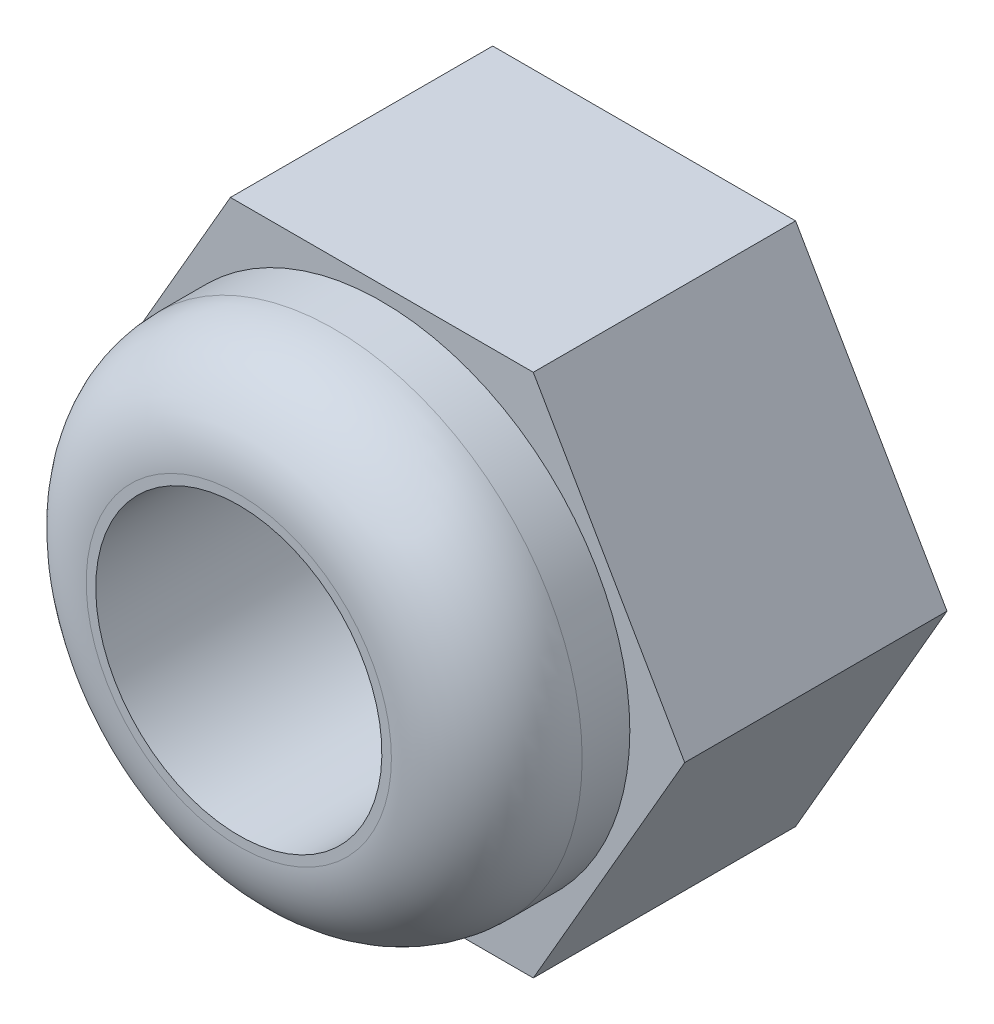
ISO-10303-21;
HEADER;
FILE_DESCRIPTION(('STEP AP214'),'2;1');
FILE_NAME('part.step','',(''),(''),'','','');
FILE_SCHEMA(('AUTOMOTIVE_DESIGN { 1 0 10303 214 1 1 1 1 }'));
ENDSEC;
DATA;
#1=APPLICATION_CONTEXT('core data for automotive mechanical design processes');
#2=APPLICATION_PROTOCOL_DEFINITION('international standard','automotive_design',2000,#1);
#3=PRODUCT_CONTEXT('',#1,'mechanical');
#4=PRODUCT('Part','Part','',(#3));
#5=PRODUCT_RELATED_PRODUCT_CATEGORY('part','',(#4));
#6=PRODUCT_DEFINITION_FORMATION('','',#4);
#7=PRODUCT_DEFINITION_CONTEXT('part definition',#1,'design');
#8=PRODUCT_DEFINITION('design','',#6,#7);
#9=PRODUCT_DEFINITION_SHAPE('','',#8);
#10=(LENGTH_UNIT() NAMED_UNIT(*) SI_UNIT(.MILLI.,.METRE.));
#11=(NAMED_UNIT(*) PLANE_ANGLE_UNIT() SI_UNIT($,.RADIAN.));
#12=(NAMED_UNIT(*) SI_UNIT($,.STERADIAN.) SOLID_ANGLE_UNIT());
#13=UNCERTAINTY_MEASURE_WITH_UNIT(LENGTH_MEASURE(1.E-05),#10,'distance_accuracy_value','');
#14=(GEOMETRIC_REPRESENTATION_CONTEXT(3) GLOBAL_UNCERTAINTY_ASSIGNED_CONTEXT((#13)) GLOBAL_UNIT_ASSIGNED_CONTEXT((#10,
#11,#12)) REPRESENTATION_CONTEXT('',''));
#15=CARTESIAN_POINT('',(0.,0.,0.));
#16=DIRECTION('',(0.,0.,1.));
#17=DIRECTION('',(1.,0.,0.));
#18=AXIS2_PLACEMENT_3D('',#15,#16,#17);
#19=CARTESIAN_POINT('',(-1.58771324027147,-2.75,0.));
#20=DIRECTION('',(0.,-1.,0.));
#21=DIRECTION('',(1.,0.,0.));
#22=AXIS2_PLACEMENT_3D('',#19,#20,#21);
#23=PLANE('',#22);
#24=DIRECTION('',(1.,0.,0.));
#25=VECTOR('',#24,1.);
#26=CARTESIAN_POINT('',(-1.58771324027147,-2.75,2.75));
#27=LINE('',#26,#25);
#28=CARTESIAN_POINT('',(-1.58771324027147,-2.75,2.75));
#29=VERTEX_POINT('',#28);
#30=CARTESIAN_POINT('',(1.58771324027147,-2.75,2.75));
#31=VERTEX_POINT('',#30);
#32=EDGE_CURVE('E122',#29,#31,#27,.T.);
#33=ORIENTED_EDGE('',*,*,#32,.F.);
#34=DIRECTION('',(0.,0.,1.));
#35=VECTOR('',#34,1.);
#36=CARTESIAN_POINT('',(-1.58771324027147,-2.75,0.));
#37=LINE('',#36,#35);
#38=CARTESIAN_POINT('',(-1.58771324027147,-2.75,0.));
#39=VERTEX_POINT('',#38);
#40=EDGE_CURVE('E51',#39,#29,#37,.T.);
#41=ORIENTED_EDGE('',*,*,#40,.F.);
#42=DIRECTION('',(1.,0.,0.));
#43=VECTOR('',#42,1.);
#44=CARTESIAN_POINT('',(-1.58771324027147,-2.75,0.));
#45=LINE('',#44,#43);
#46=CARTESIAN_POINT('',(1.58771324027147,-2.75,0.));
#47=VERTEX_POINT('',#46);
#48=EDGE_CURVE('E138',#39,#47,#45,.T.);
#49=ORIENTED_EDGE('',*,*,#48,.T.);
#50=DIRECTION('',(0.,0.,1.));
#51=VECTOR('',#50,1.);
#52=CARTESIAN_POINT('',(1.58771324027147,-2.75,0.));
#53=LINE('',#52,#51);
#54=EDGE_CURVE('E86',#47,#31,#53,.T.);
#55=ORIENTED_EDGE('',*,*,#54,.T.);
#56=EDGE_LOOP('',(#33,#41,#49,#55));
#57=FACE_BOUND('',#56,.T.);
#58=ADVANCED_FACE('F34',(#57),#23,.T.);
#59=CARTESIAN_POINT('',(-3.17542648054294,0.,0.));
#60=DIRECTION('',(-0.866025403784438,-0.500000000000001,0.));
#61=DIRECTION('',(0.500000000000001,-0.866025403784438,0.));
#62=AXIS2_PLACEMENT_3D('',#59,#60,#61);
#63=PLANE('',#62);
#64=DIRECTION('',(0.500000000000001,-0.866025403784438,0.));
#65=VECTOR('',#64,1.);
#66=CARTESIAN_POINT('',(-3.17542648054294,0.,2.75));
#67=LINE('',#66,#65);
#68=CARTESIAN_POINT('',(-3.17542648054294,0.,2.75));
#69=VERTEX_POINT('',#68);
#70=EDGE_CURVE('E135',#69,#29,#67,.T.);
#71=ORIENTED_EDGE('',*,*,#70,.F.);
#72=DIRECTION('',(0.,0.,1.));
#73=VECTOR('',#72,1.);
#74=CARTESIAN_POINT('',(-3.17542648054294,0.,0.));
#75=LINE('',#74,#73);
#76=CARTESIAN_POINT('',(-3.17542648054294,0.,0.));
#77=VERTEX_POINT('',#76);
#78=EDGE_CURVE('E74',#77,#69,#75,.T.);
#79=ORIENTED_EDGE('',*,*,#78,.F.);
#80=DIRECTION('',(0.500000000000001,-0.866025403784438,0.));
#81=VECTOR('',#80,1.);
#82=CARTESIAN_POINT('',(-3.17542648054294,0.,0.));
#83=LINE('',#82,#81);
#84=EDGE_CURVE('E112',#77,#39,#83,.T.);
#85=ORIENTED_EDGE('',*,*,#84,.T.);
#86=ORIENTED_EDGE('',*,*,#40,.T.);
#87=EDGE_LOOP('',(#71,#79,#85,#86));
#88=FACE_BOUND('',#87,.T.);
#89=ADVANCED_FACE('F163',(#88),#63,.T.);
#90=CARTESIAN_POINT('',(-1.58771324027147,2.75,0.));
#91=DIRECTION('',(-0.866025403784439,0.499999999999999,0.));
#92=DIRECTION('',(-0.499999999999999,-0.866025403784439,0.));
#93=AXIS2_PLACEMENT_3D('',#90,#91,#92);
#94=PLANE('',#93);
#95=DIRECTION('',(-0.499999999999999,-0.866025403784439,0.));
#96=VECTOR('',#95,1.);
#97=CARTESIAN_POINT('',(-1.58771324027147,2.75,2.75));
#98=LINE('',#97,#96);
#99=CARTESIAN_POINT('',(-1.58771324027147,2.75,2.75));
#100=VERTEX_POINT('',#99);
#101=EDGE_CURVE('E99',#100,#69,#98,.T.);
#102=ORIENTED_EDGE('',*,*,#101,.F.);
#103=DIRECTION('',(0.,0.,1.));
#104=VECTOR('',#103,1.);
#105=CARTESIAN_POINT('',(-1.58771324027147,2.75,0.));
#106=LINE('',#105,#104);
#107=CARTESIAN_POINT('',(-1.58771324027147,2.75,0.));
#108=VERTEX_POINT('',#107);
#109=EDGE_CURVE('E94',#108,#100,#106,.T.);
#110=ORIENTED_EDGE('',*,*,#109,.F.);
#111=DIRECTION('',(-0.499999999999999,-0.866025403784439,0.));
#112=VECTOR('',#111,1.);
#113=CARTESIAN_POINT('',(-1.58771324027147,2.75,0.));
#114=LINE('',#113,#112);
#115=EDGE_CURVE('E97',#108,#77,#114,.T.);
#116=ORIENTED_EDGE('',*,*,#115,.T.);
#117=ORIENTED_EDGE('',*,*,#78,.T.);
#118=EDGE_LOOP('',(#102,#110,#116,#117));
#119=FACE_BOUND('',#118,.T.);
#120=ADVANCED_FACE('F96',(#119),#94,.T.);
#121=CARTESIAN_POINT('',(1.58771324027147,2.75,0.));
#122=DIRECTION('',(0.,1.,0.));
#123=DIRECTION('',(-1.,0.,0.));
#124=AXIS2_PLACEMENT_3D('',#121,#122,#123);
#125=PLANE('',#124);
#126=DIRECTION('',(-1.,0.,0.));
#127=VECTOR('',#126,1.);
#128=CARTESIAN_POINT('',(1.58771324027147,2.75,2.75));
#129=LINE('',#128,#127);
#130=CARTESIAN_POINT('',(1.58771324027147,2.75,2.75));
#131=VERTEX_POINT('',#130);
#132=EDGE_CURVE('E132',#131,#100,#129,.T.);
#133=ORIENTED_EDGE('',*,*,#132,.F.);
#134=DIRECTION('',(0.,0.,1.));
#135=VECTOR('',#134,1.);
#136=CARTESIAN_POINT('',(1.58771324027147,2.75,0.));
#137=LINE('',#136,#135);
#138=CARTESIAN_POINT('',(1.58771324027147,2.75,0.));
#139=VERTEX_POINT('',#138);
#140=EDGE_CURVE('E104',#139,#131,#137,.T.);
#141=ORIENTED_EDGE('',*,*,#140,.F.);
#142=DIRECTION('',(-1.,0.,0.));
#143=VECTOR('',#142,1.);
#144=CARTESIAN_POINT('',(1.58771324027147,2.75,0.));
#145=LINE('',#144,#143);
#146=EDGE_CURVE('E110',#139,#108,#145,.T.);
#147=ORIENTED_EDGE('',*,*,#146,.T.);
#148=ORIENTED_EDGE('',*,*,#109,.T.);
#149=EDGE_LOOP('',(#133,#141,#147,#148));
#150=FACE_BOUND('',#149,.T.);
#151=ADVANCED_FACE('F114',(#150),#125,.T.);
#152=CARTESIAN_POINT('',(3.17542648054294,0.,0.));
#153=DIRECTION('',(0.866025403784438,0.500000000000001,0.));
#154=DIRECTION('',(-0.500000000000001,0.866025403784438,0.));
#155=AXIS2_PLACEMENT_3D('',#152,#153,#154);
#156=PLANE('',#155);
#157=DIRECTION('',(-0.500000000000001,0.866025403784438,0.));
#158=VECTOR('',#157,1.);
#159=CARTESIAN_POINT('',(3.17542648054294,0.,2.75));
#160=LINE('',#159,#158);
#161=CARTESIAN_POINT('',(3.17542648054294,0.,2.75));
#162=VERTEX_POINT('',#161);
#163=EDGE_CURVE('E129',#162,#131,#160,.T.);
#164=ORIENTED_EDGE('',*,*,#163,.F.);
#165=DIRECTION('',(0.,0.,1.));
#166=VECTOR('',#165,1.);
#167=CARTESIAN_POINT('',(3.17542648054294,0.,0.));
#168=LINE('',#167,#166);
#169=CARTESIAN_POINT('',(3.17542648054294,0.,0.));
#170=VERTEX_POINT('',#169);
#171=EDGE_CURVE('E143',#170,#162,#168,.T.);
#172=ORIENTED_EDGE('',*,*,#171,.F.);
#173=DIRECTION('',(-0.500000000000001,0.866025403784438,0.));
#174=VECTOR('',#173,1.);
#175=CARTESIAN_POINT('',(3.17542648054294,0.,0.));
#176=LINE('',#175,#174);
#177=EDGE_CURVE('E115',#170,#139,#176,.T.);
#178=ORIENTED_EDGE('',*,*,#177,.T.);
#179=ORIENTED_EDGE('',*,*,#140,.T.);
#180=EDGE_LOOP('',(#164,#172,#178,#179));
#181=FACE_BOUND('',#180,.T.);
#182=ADVANCED_FACE('F172',(#181),#156,.T.);
#183=CARTESIAN_POINT('',(1.58771324027147,-2.75,0.));
#184=DIRECTION('',(0.866025403784439,-0.5,0.));
#185=DIRECTION('',(0.5,0.866025403784439,0.));
#186=AXIS2_PLACEMENT_3D('',#183,#184,#185);
#187=PLANE('',#186);
#188=DIRECTION('',(0.5,0.866025403784439,0.));
#189=VECTOR('',#188,1.);
#190=CARTESIAN_POINT('',(1.58771324027147,-2.75,2.75));
#191=LINE('',#190,#189);
#192=EDGE_CURVE('E125',#31,#162,#191,.T.);
#193=ORIENTED_EDGE('',*,*,#192,.F.);
#194=ORIENTED_EDGE('',*,*,#54,.F.);
#195=DIRECTION('',(0.5,0.866025403784439,0.));
#196=VECTOR('',#195,1.);
#197=CARTESIAN_POINT('',(1.58771324027147,-2.75,0.));
#198=LINE('',#197,#196);
#199=EDGE_CURVE('E117',#47,#170,#198,.T.);
#200=ORIENTED_EDGE('',*,*,#199,.T.);
#201=ORIENTED_EDGE('',*,*,#171,.T.);
#202=EDGE_LOOP('',(#193,#194,#200,#201));
#203=FACE_BOUND('',#202,.T.);
#204=ADVANCED_FACE('F169',(#203),#187,.T.);
#205=CARTESIAN_POINT('',(0.,0.,0.));
#206=DIRECTION('',(0.,0.,1.));
#207=DIRECTION('',(1.,0.,0.));
#208=AXIS2_PLACEMENT_3D('',#205,#206,#207);
#209=PLANE('',#208);
#210=CARTESIAN_POINT('',(0.,0.,0.));
#211=DIRECTION('',(0.,0.,-1.));
#212=DIRECTION('',(0.,1.,0.));
#213=AXIS2_PLACEMENT_3D('',#210,#211,#212);
#214=CIRCLE('',#213,1.49999999999998);
#215=CARTESIAN_POINT('',(0.,1.49999999999999,0.));
#216=VERTEX_POINT('',#215);
#217=EDGE_CURVE('E268',#216,#216,#214,.T.);
#218=ORIENTED_EDGE('',*,*,#217,.F.);
#219=EDGE_LOOP('',(#218));
#220=FACE_BOUND('',#219,.T.);
#221=ORIENTED_EDGE('',*,*,#48,.F.);
#222=ORIENTED_EDGE('',*,*,#84,.F.);
#223=ORIENTED_EDGE('',*,*,#115,.F.);
#224=ORIENTED_EDGE('',*,*,#146,.F.);
#225=ORIENTED_EDGE('',*,*,#177,.F.);
#226=ORIENTED_EDGE('',*,*,#199,.F.);
#227=EDGE_LOOP('',(#221,#222,#223,#224,#225,#226));
#228=FACE_BOUND('',#227,.T.);
#229=ADVANCED_FACE('F108',(#220,#228),#209,.F.);
#230=CARTESIAN_POINT('',(0.,0.,2.75));
#231=DIRECTION('',(0.,0.,1.));
#232=DIRECTION('',(1.,0.,0.));
#233=AXIS2_PLACEMENT_3D('',#230,#231,#232);
#234=PLANE('',#233);
#235=CARTESIAN_POINT('',(0.,0.,2.75));
#236=DIRECTION('',(0.,0.,1.));
#237=DIRECTION('',(1.,0.,0.));
#238=AXIS2_PLACEMENT_3D('',#235,#236,#237);
#239=CIRCLE('',#238,2.6);
#240=CARTESIAN_POINT('',(2.6,0.,2.75));
#241=VERTEX_POINT('',#240);
#242=EDGE_CURVE('E140',#241,#241,#239,.T.);
#243=ORIENTED_EDGE('',*,*,#242,.F.);
#244=EDGE_LOOP('',(#243));
#245=FACE_BOUND('',#244,.T.);
#246=ORIENTED_EDGE('',*,*,#32,.T.);
#247=ORIENTED_EDGE('',*,*,#192,.T.);
#248=ORIENTED_EDGE('',*,*,#163,.T.);
#249=ORIENTED_EDGE('',*,*,#132,.T.);
#250=ORIENTED_EDGE('',*,*,#101,.T.);
#251=ORIENTED_EDGE('',*,*,#70,.T.);
#252=EDGE_LOOP('',(#246,#247,#248,#249,#250,#251));
#253=FACE_BOUND('',#252,.T.);
#254=ADVANCED_FACE('F180',(#245,#253),#234,.T.);
#255=CARTESIAN_POINT('',(0.,0.,2.75));
#256=DIRECTION('',(0.,0.,1.));
#257=DIRECTION('',(1.,0.,0.));
#258=AXIS2_PLACEMENT_3D('',#255,#256,#257);
#259=CYLINDRICAL_SURFACE('',#258,2.6);
#260=CARTESIAN_POINT('',(0.,0.,3.25));
#261=DIRECTION('',(0.,0.,1.));
#262=DIRECTION('',(1.,0.,0.));
#263=AXIS2_PLACEMENT_3D('',#260,#261,#262);
#264=CIRCLE('',#263,2.6);
#265=CARTESIAN_POINT('',(2.6,0.,3.25));
#266=VERTEX_POINT('',#265);
#267=EDGE_CURVE('E11',#266,#266,#264,.F.);
#268=ORIENTED_EDGE('',*,*,#267,.T.);
#269=EDGE_LOOP('',(#268));
#270=FACE_BOUND('',#269,.T.);
#271=ORIENTED_EDGE('',*,*,#242,.T.);
#272=EDGE_LOOP('',(#271));
#273=FACE_BOUND('',#272,.T.);
#274=ADVANCED_FACE('F183',(#270,#273),#259,.T.);
#275=CARTESIAN_POINT('',(0.,0.,4.25));
#276=DIRECTION('',(0.,0.,1.));
#277=DIRECTION('',(1.,0.,0.));
#278=AXIS2_PLACEMENT_3D('',#275,#276,#277);
#279=PLANE('',#278);
#280=CARTESIAN_POINT('',(0.,0.,4.25));
#281=DIRECTION('',(0.,0.,1.));
#282=DIRECTION('',(1.,0.,0.));
#283=AXIS2_PLACEMENT_3D('',#280,#281,#282);
#284=CIRCLE('',#283,1.6);
#285=CARTESIAN_POINT('',(1.6,0.,4.25));
#286=VERTEX_POINT('',#285);
#287=EDGE_CURVE('E43',#286,#286,#284,.T.);
#288=ORIENTED_EDGE('',*,*,#287,.T.);
#289=EDGE_LOOP('',(#288));
#290=FACE_BOUND('',#289,.T.);
#291=CARTESIAN_POINT('',(0.,0.,4.25));
#292=DIRECTION('',(0.,0.,-1.));
#293=DIRECTION('',(0.,1.,0.));
#294=AXIS2_PLACEMENT_3D('',#291,#292,#293);
#295=CIRCLE('',#294,1.49999999999998);
#296=CARTESIAN_POINT('',(0.,1.49999999999999,4.25));
#297=VERTEX_POINT('',#296);
#298=EDGE_CURVE('E126',#297,#297,#295,.T.);
#299=ORIENTED_EDGE('',*,*,#298,.T.);
#300=EDGE_LOOP('',(#299));
#301=FACE_BOUND('',#300,.T.);
#302=ADVANCED_FACE('F150',(#290,#301),#279,.T.);
#303=CARTESIAN_POINT('',(0.,0.,0.));
#304=DIRECTION('',(0.,0.,-1.));
#305=DIRECTION('',(0.,1.,0.));
#306=AXIS2_PLACEMENT_3D('',#303,#304,#305);
#307=CYLINDRICAL_SURFACE('',#306,1.49999999999998);
#308=ORIENTED_EDGE('',*,*,#298,.F.);
#309=EDGE_LOOP('',(#308));
#310=FACE_BOUND('',#309,.T.);
#311=ORIENTED_EDGE('',*,*,#217,.T.);
#312=EDGE_LOOP('',(#311));
#313=FACE_BOUND('',#312,.T.);
#314=ADVANCED_FACE('F154',(#310,#313),#307,.F.);
#315=CARTESIAN_POINT('',(0.,0.,3.25));
#316=DIRECTION('',(0.,0.,1.));
#317=DIRECTION('',(1.,0.,0.));
#318=AXIS2_PLACEMENT_3D('',#315,#316,#317);
#319=TOROIDAL_SURFACE('',#318,1.6,1.);
#320=ORIENTED_EDGE('',*,*,#267,.F.);
#321=EDGE_LOOP('',(#320));
#322=FACE_BOUND('',#321,.T.);
#323=ORIENTED_EDGE('',*,*,#287,.F.);
#324=EDGE_LOOP('',(#323));
#325=FACE_BOUND('',#324,.T.);
#326=ADVANCED_FACE('F36',(#322,#325),#319,.T.);
#327=CLOSED_SHELL('',(#58,#89,#120,#151,#182,#204,#229,#254,#274,#302,#314,#326));
#328=MANIFOLD_SOLID_BREP('B2',#327);
#329=ADVANCED_BREP_SHAPE_REPRESENTATION('',(#18,#328),#14);
#330=SHAPE_DEFINITION_REPRESENTATION(#9,#329);
ENDSEC;
END-ISO-10303-21;
